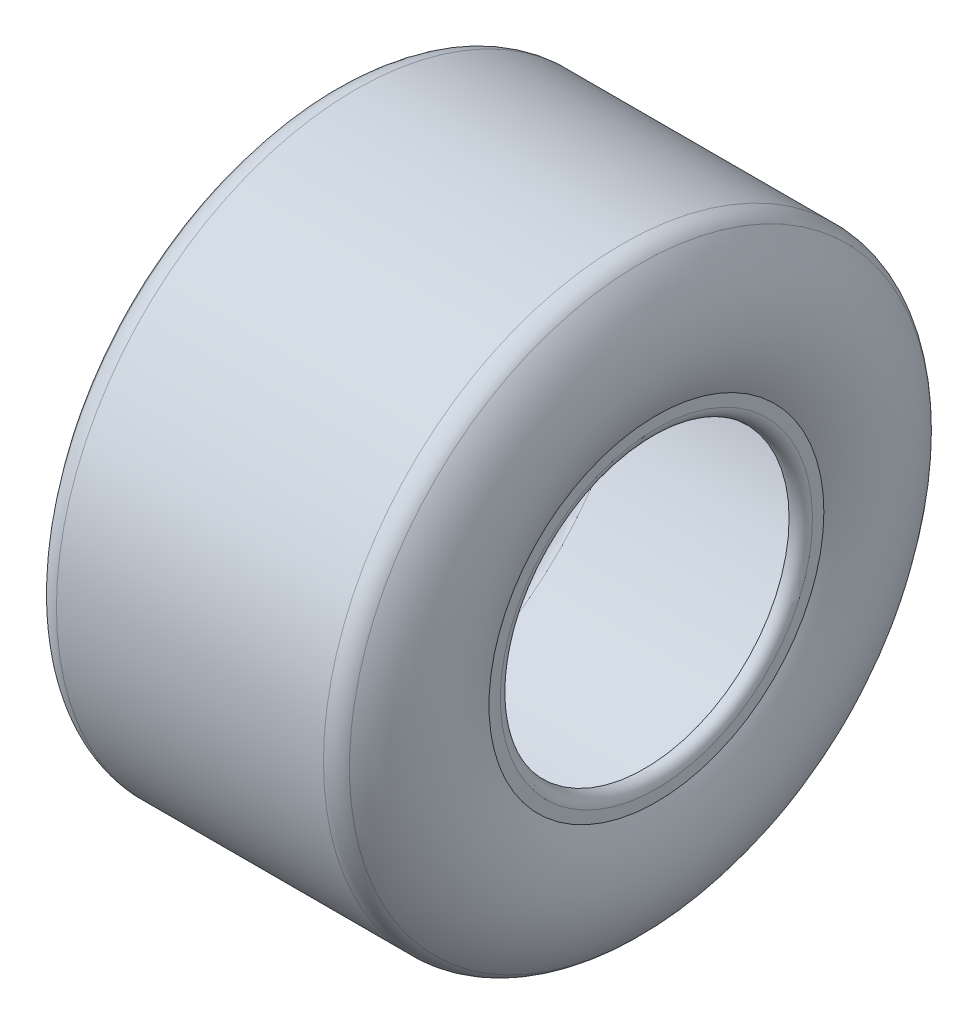
ISO-10303-21;
HEADER;
FILE_DESCRIPTION(('STEP AP214'),'2;1');
FILE_NAME('part.step','',(''),(''),'','','');
FILE_SCHEMA(('AUTOMOTIVE_DESIGN { 1 0 10303 214 1 1 1 1 }'));
ENDSEC;
DATA;
#1=APPLICATION_CONTEXT('core data for automotive mechanical design processes');
#2=APPLICATION_PROTOCOL_DEFINITION('international standard','automotive_design',2000,#1);
#3=PRODUCT_CONTEXT('',#1,'mechanical');
#4=PRODUCT('Part','Part','',(#3));
#5=PRODUCT_RELATED_PRODUCT_CATEGORY('part','',(#4));
#6=PRODUCT_DEFINITION_FORMATION('','',#4);
#7=PRODUCT_DEFINITION_CONTEXT('part definition',#1,'design');
#8=PRODUCT_DEFINITION('design','',#6,#7);
#9=PRODUCT_DEFINITION_SHAPE('','',#8);
#10=(LENGTH_UNIT() NAMED_UNIT(*) SI_UNIT(.MILLI.,.METRE.));
#11=(NAMED_UNIT(*) PLANE_ANGLE_UNIT() SI_UNIT($,.RADIAN.));
#12=(NAMED_UNIT(*) SI_UNIT($,.STERADIAN.) SOLID_ANGLE_UNIT());
#13=UNCERTAINTY_MEASURE_WITH_UNIT(LENGTH_MEASURE(1.E-05),#10,'distance_accuracy_value','');
#14=(GEOMETRIC_REPRESENTATION_CONTEXT(3) GLOBAL_UNCERTAINTY_ASSIGNED_CONTEXT((#13)) GLOBAL_UNIT_ASSIGNED_CONTEXT((#10,
#11,#12)) REPRESENTATION_CONTEXT('',''));
#15=CARTESIAN_POINT('',(0.,0.,0.));
#16=DIRECTION('',(0.,0.,1.));
#17=DIRECTION('',(1.,0.,0.));
#18=AXIS2_PLACEMENT_3D('',#15,#16,#17);
#19=CARTESIAN_POINT('',(55.8152266644166,0.,0.));
#20=DIRECTION('',(1.,0.,0.));
#21=DIRECTION('',(0.,0.,-1.));
#22=AXIS2_PLACEMENT_3D('',#19,#20,#21);
#23=TOROIDAL_SURFACE('',#22,115.,10.);
#24=CARTESIAN_POINT('',(55.8152266644166,0.,0.));
#25=DIRECTION('',(1.,0.,0.));
#26=DIRECTION('',(0.,0.,-1.));
#27=AXIS2_PLACEMENT_3D('',#24,#25,#26);
#28=CIRCLE('',#27,125.);
#29=CARTESIAN_POINT('',(55.8152266644166,0.,-125.));
#30=VERTEX_POINT('',#29);
#31=EDGE_CURVE('E10',#30,#30,#28,.T.);
#32=ORIENTED_EDGE('',*,*,#31,.T.);
#33=EDGE_LOOP('',(#32));
#34=FACE_BOUND('',#33,.T.);
#35=CARTESIAN_POINT('',(63.3059142321507,0.,0.));
#36=DIRECTION('',(1.,0.,0.));
#37=DIRECTION('',(0.,0.,-1.));
#38=AXIS2_PLACEMENT_3D('',#35,#36,#37);
#39=CIRCLE('',#38,121.62492262314);
#40=CARTESIAN_POINT('',(63.3059142321507,0.,-121.62492262314));
#41=VERTEX_POINT('',#40);
#42=EDGE_CURVE('E40',#41,#41,#39,.T.);
#43=ORIENTED_EDGE('',*,*,#42,.F.);
#44=EDGE_LOOP('',(#43));
#45=FACE_BOUND('',#44,.T.);
#46=ADVANCED_FACE('F34',(#34,#45),#23,.T.);
#47=CARTESIAN_POINT('',(28.5310288243146,0.,0.));
#48=DIRECTION('',(1.,0.,0.));
#49=DIRECTION('',(0.,0.,-1.));
#50=AXIS2_PLACEMENT_3D('',#47,#48,#49);
#51=TOROIDAL_SURFACE('',#50,90.8692779680572,46.4241567858574);
#52=ORIENTED_EDGE('',*,*,#42,.T.);
#53=EDGE_LOOP('',(#52));
#54=FACE_BOUND('',#53,.T.);
#55=CARTESIAN_POINT('',(70.,0.,0.));
#56=DIRECTION('',(1.,0.,0.));
#57=DIRECTION('',(0.,0.,-1.));
#58=AXIS2_PLACEMENT_3D('',#55,#56,#57);
#59=CIRCLE('',#58,70.);
#60=CARTESIAN_POINT('',(70.,0.,-70.));
#61=VERTEX_POINT('',#60);
#62=EDGE_CURVE('E44',#61,#61,#59,.T.);
#63=ORIENTED_EDGE('',*,*,#62,.F.);
#64=EDGE_LOOP('',(#63));
#65=FACE_BOUND('',#64,.T.);
#66=ADVANCED_FACE('F107',(#54,#65),#51,.T.);
#67=CARTESIAN_POINT('',(70.,70.,0.));
#68=DIRECTION('',(1.,0.,0.));
#69=DIRECTION('',(0.,0.,-1.));
#70=AXIS2_PLACEMENT_3D('',#67,#68,#69);
#71=PLANE('',#70);
#72=ORIENTED_EDGE('',*,*,#62,.T.);
#73=EDGE_LOOP('',(#72));
#74=FACE_BOUND('',#73,.T.);
#75=CARTESIAN_POINT('',(70.,0.,0.));
#76=DIRECTION('',(1.,0.,0.));
#77=DIRECTION('',(0.,0.,-1.));
#78=AXIS2_PLACEMENT_3D('',#75,#76,#77);
#79=CIRCLE('',#78,65.23);
#80=CARTESIAN_POINT('',(70.,0.,-65.23));
#81=VERTEX_POINT('',#80);
#82=EDGE_CURVE('E48',#81,#81,#79,.T.);
#83=ORIENTED_EDGE('',*,*,#82,.F.);
#84=EDGE_LOOP('',(#83));
#85=FACE_BOUND('',#84,.T.);
#86=ADVANCED_FACE('F111',(#74,#85),#71,.T.);
#87=CARTESIAN_POINT('',(65.115,0.,0.));
#88=DIRECTION('',(1.,0.,0.));
#89=DIRECTION('',(0.,0.,-1.));
#90=AXIS2_PLACEMENT_3D('',#87,#88,#89);
#91=TOROIDAL_SURFACE('',#90,65.345,4.88635344607817);
#92=ORIENTED_EDGE('',*,*,#82,.T.);
#93=EDGE_LOOP('',(#92));
#94=FACE_BOUND('',#93,.T.);
#95=CARTESIAN_POINT('',(65.,0.,0.));
#96=DIRECTION('',(1.,0.,0.));
#97=DIRECTION('',(0.,0.,-1.));
#98=AXIS2_PLACEMENT_3D('',#95,#96,#97);
#99=CIRCLE('',#98,60.46);
#100=CARTESIAN_POINT('',(65.,0.,-60.46));
#101=VERTEX_POINT('',#100);
#102=EDGE_CURVE('E53',#101,#101,#99,.T.);
#103=ORIENTED_EDGE('',*,*,#102,.F.);
#104=EDGE_LOOP('',(#103));
#105=FACE_BOUND('',#104,.T.);
#106=ADVANCED_FACE('F116',(#94,#105),#91,.T.);
#107=CARTESIAN_POINT('',(65.,71.2230338790126,0.));
#108=DIRECTION('',(-1.,0.,0.));
#109=DIRECTION('',(0.,0.,1.));
#110=AXIS2_PLACEMENT_3D('',#107,#108,#109);
#111=PLANE('',#110);
#112=ORIENTED_EDGE('',*,*,#102,.T.);
#113=EDGE_LOOP('',(#112));
#114=FACE_BOUND('',#113,.T.);
#115=CARTESIAN_POINT('',(65.,0.,0.));
#116=DIRECTION('',(1.,0.,0.));
#117=DIRECTION('',(0.,0.,-1.));
#118=AXIS2_PLACEMENT_3D('',#115,#116,#117);
#119=CIRCLE('',#118,71.2230338790126);
#120=CARTESIAN_POINT('',(65.,0.,-71.2230338790126));
#121=VERTEX_POINT('',#120);
#122=EDGE_CURVE('E56',#121,#121,#119,.T.);
#123=ORIENTED_EDGE('',*,*,#122,.F.);
#124=EDGE_LOOP('',(#123));
#125=FACE_BOUND('',#124,.T.);
#126=ADVANCED_FACE('F123',(#114,#125),#111,.T.);
#127=CARTESIAN_POINT('',(28.5310288243146,0.,0.));
#128=DIRECTION('',(1.,0.,0.));
#129=DIRECTION('',(0.,0.,-1.));
#130=AXIS2_PLACEMENT_3D('',#127,#128,#129);
#131=TOROIDAL_SURFACE('',#130,90.8692779680572,41.4241567858574);
#132=ORIENTED_EDGE('',*,*,#122,.T.);
#133=EDGE_LOOP('',(#132));
#134=FACE_BOUND('',#133,.T.);
#135=CARTESIAN_POINT('',(59.5605704482837,0.,0.));
#136=DIRECTION('',(1.,0.,0.));
#137=DIRECTION('',(0.,0.,-1.));
#138=AXIS2_PLACEMENT_3D('',#135,#136,#137);
#139=CIRCLE('',#138,118.31246131157);
#140=CARTESIAN_POINT('',(59.5605704482837,0.,-118.31246131157));
#141=VERTEX_POINT('',#140);
#142=EDGE_CURVE('E59',#141,#141,#139,.T.);
#143=ORIENTED_EDGE('',*,*,#142,.F.);
#144=EDGE_LOOP('',(#143));
#145=FACE_BOUND('',#144,.T.);
#146=ADVANCED_FACE('F127',(#134,#145),#131,.F.);
#147=CARTESIAN_POINT('',(55.8152266644166,0.,0.));
#148=DIRECTION('',(1.,0.,0.));
#149=DIRECTION('',(0.,0.,-1.));
#150=AXIS2_PLACEMENT_3D('',#147,#148,#149);
#151=TOROIDAL_SURFACE('',#150,115.,5.);
#152=ORIENTED_EDGE('',*,*,#142,.T.);
#153=EDGE_LOOP('',(#152));
#154=FACE_BOUND('',#153,.T.);
#155=CARTESIAN_POINT('',(55.8152266644166,0.,0.));
#156=DIRECTION('',(1.,0.,0.));
#157=DIRECTION('',(0.,0.,-1.));
#158=AXIS2_PLACEMENT_3D('',#155,#156,#157);
#159=CIRCLE('',#158,120.);
#160=CARTESIAN_POINT('',(55.8152266644166,0.,-120.));
#161=VERTEX_POINT('',#160);
#162=EDGE_CURVE('E62',#161,#161,#159,.T.);
#163=ORIENTED_EDGE('',*,*,#162,.F.);
#164=EDGE_LOOP('',(#163));
#165=FACE_BOUND('',#164,.T.);
#166=ADVANCED_FACE('F131',(#154,#165),#151,.F.);
#167=CARTESIAN_POINT('',(0.,0.,0.));
#168=DIRECTION('',(1.,0.,0.));
#169=DIRECTION('',(0.,0.,-1.));
#170=AXIS2_PLACEMENT_3D('',#167,#168,#169);
#171=CYLINDRICAL_SURFACE('',#170,120.);
#172=ORIENTED_EDGE('',*,*,#162,.T.);
#173=EDGE_LOOP('',(#172));
#174=FACE_BOUND('',#173,.T.);
#175=CARTESIAN_POINT('',(-55.8152266644166,0.,0.));
#176=DIRECTION('',(1.,0.,0.));
#177=DIRECTION('',(0.,0.,-1.));
#178=AXIS2_PLACEMENT_3D('',#175,#176,#177);
#179=CIRCLE('',#178,120.);
#180=CARTESIAN_POINT('',(-55.8152266644166,0.,-120.));
#181=VERTEX_POINT('',#180);
#182=EDGE_CURVE('E65',#181,#181,#179,.T.);
#183=ORIENTED_EDGE('',*,*,#182,.F.);
#184=EDGE_LOOP('',(#183));
#185=FACE_BOUND('',#184,.T.);
#186=ADVANCED_FACE('F135',(#174,#185),#171,.F.);
#187=CARTESIAN_POINT('',(-55.8152266644166,0.,0.));
#188=DIRECTION('',(1.,0.,0.));
#189=DIRECTION('',(0.,0.,-1.));
#190=AXIS2_PLACEMENT_3D('',#187,#188,#189);
#191=TOROIDAL_SURFACE('',#190,115.,5.);
#192=ORIENTED_EDGE('',*,*,#182,.T.);
#193=EDGE_LOOP('',(#192));
#194=FACE_BOUND('',#193,.T.);
#195=CARTESIAN_POINT('',(-59.5605704482837,0.,0.));
#196=DIRECTION('',(1.,0.,0.));
#197=DIRECTION('',(0.,0.,-1.));
#198=AXIS2_PLACEMENT_3D('',#195,#196,#197);
#199=CIRCLE('',#198,118.31246131157);
#200=CARTESIAN_POINT('',(-59.5605704482837,0.,-118.31246131157));
#201=VERTEX_POINT('',#200);
#202=EDGE_CURVE('E68',#201,#201,#199,.T.);
#203=ORIENTED_EDGE('',*,*,#202,.F.);
#204=EDGE_LOOP('',(#203));
#205=FACE_BOUND('',#204,.T.);
#206=ADVANCED_FACE('F139',(#194,#205),#191,.F.);
#207=CARTESIAN_POINT('',(-28.5310288243146,0.,0.));
#208=DIRECTION('',(1.,0.,0.));
#209=DIRECTION('',(0.,0.,-1.));
#210=AXIS2_PLACEMENT_3D('',#207,#208,#209);
#211=TOROIDAL_SURFACE('',#210,90.8692779680572,41.4241567858574);
#212=ORIENTED_EDGE('',*,*,#202,.T.);
#213=EDGE_LOOP('',(#212));
#214=FACE_BOUND('',#213,.T.);
#215=CARTESIAN_POINT('',(-65.,0.,0.));
#216=DIRECTION('',(1.,0.,0.));
#217=DIRECTION('',(0.,0.,-1.));
#218=AXIS2_PLACEMENT_3D('',#215,#216,#217);
#219=CIRCLE('',#218,71.2230338790126);
#220=CARTESIAN_POINT('',(-65.,0.,-71.2230338790126));
#221=VERTEX_POINT('',#220);
#222=EDGE_CURVE('E71',#221,#221,#219,.T.);
#223=ORIENTED_EDGE('',*,*,#222,.F.);
#224=EDGE_LOOP('',(#223));
#225=FACE_BOUND('',#224,.T.);
#226=ADVANCED_FACE('F143',(#214,#225),#211,.F.);
#227=CARTESIAN_POINT('',(-65.,71.2230338790126,0.));
#228=DIRECTION('',(1.,0.,0.));
#229=DIRECTION('',(0.,0.,-1.));
#230=AXIS2_PLACEMENT_3D('',#227,#228,#229);
#231=PLANE('',#230);
#232=ORIENTED_EDGE('',*,*,#222,.T.);
#233=EDGE_LOOP('',(#232));
#234=FACE_BOUND('',#233,.T.);
#235=CARTESIAN_POINT('',(-65.,0.,0.));
#236=DIRECTION('',(1.,0.,0.));
#237=DIRECTION('',(0.,0.,-1.));
#238=AXIS2_PLACEMENT_3D('',#235,#236,#237);
#239=CIRCLE('',#238,60.46);
#240=CARTESIAN_POINT('',(-65.,0.,-60.46));
#241=VERTEX_POINT('',#240);
#242=EDGE_CURVE('E74',#241,#241,#239,.T.);
#243=ORIENTED_EDGE('',*,*,#242,.F.);
#244=EDGE_LOOP('',(#243));
#245=FACE_BOUND('',#244,.T.);
#246=ADVANCED_FACE('F147',(#234,#245),#231,.T.);
#247=CARTESIAN_POINT('',(-65.115,0.,0.));
#248=DIRECTION('',(1.,0.,0.));
#249=DIRECTION('',(0.,0.,-1.));
#250=AXIS2_PLACEMENT_3D('',#247,#248,#249);
#251=TOROIDAL_SURFACE('',#250,65.345,4.88635344607817);
#252=ORIENTED_EDGE('',*,*,#242,.T.);
#253=EDGE_LOOP('',(#252));
#254=FACE_BOUND('',#253,.T.);
#255=CARTESIAN_POINT('',(-70.,0.,0.));
#256=DIRECTION('',(1.,0.,0.));
#257=DIRECTION('',(0.,0.,-1.));
#258=AXIS2_PLACEMENT_3D('',#255,#256,#257);
#259=CIRCLE('',#258,65.23);
#260=CARTESIAN_POINT('',(-70.,0.,-65.23));
#261=VERTEX_POINT('',#260);
#262=EDGE_CURVE('E77',#261,#261,#259,.T.);
#263=ORIENTED_EDGE('',*,*,#262,.F.);
#264=EDGE_LOOP('',(#263));
#265=FACE_BOUND('',#264,.T.);
#266=ADVANCED_FACE('F151',(#254,#265),#251,.T.);
#267=CARTESIAN_POINT('',(-70.,70.,0.));
#268=DIRECTION('',(-1.,0.,0.));
#269=DIRECTION('',(0.,0.,1.));
#270=AXIS2_PLACEMENT_3D('',#267,#268,#269);
#271=PLANE('',#270);
#272=ORIENTED_EDGE('',*,*,#262,.T.);
#273=EDGE_LOOP('',(#272));
#274=FACE_BOUND('',#273,.T.);
#275=CARTESIAN_POINT('',(-70.,0.,0.));
#276=DIRECTION('',(1.,0.,0.));
#277=DIRECTION('',(0.,0.,-1.));
#278=AXIS2_PLACEMENT_3D('',#275,#276,#277);
#279=CIRCLE('',#278,70.);
#280=CARTESIAN_POINT('',(-70.,0.,-70.));
#281=VERTEX_POINT('',#280);
#282=EDGE_CURVE('E80',#281,#281,#279,.T.);
#283=ORIENTED_EDGE('',*,*,#282,.F.);
#284=EDGE_LOOP('',(#283));
#285=FACE_BOUND('',#284,.T.);
#286=ADVANCED_FACE('F103',(#274,#285),#271,.T.);
#287=CARTESIAN_POINT('',(-28.5310288243146,0.,0.));
#288=DIRECTION('',(1.,0.,0.));
#289=DIRECTION('',(0.,0.,-1.));
#290=AXIS2_PLACEMENT_3D('',#287,#288,#289);
#291=TOROIDAL_SURFACE('',#290,90.8692779680572,46.4241567858574);
#292=ORIENTED_EDGE('',*,*,#282,.T.);
#293=EDGE_LOOP('',(#292));
#294=FACE_BOUND('',#293,.T.);
#295=CARTESIAN_POINT('',(-63.3059142321507,0.,0.));
#296=DIRECTION('',(1.,0.,0.));
#297=DIRECTION('',(0.,0.,-1.));
#298=AXIS2_PLACEMENT_3D('',#295,#296,#297);
#299=CIRCLE('',#298,121.62492262314);
#300=CARTESIAN_POINT('',(-63.3059142321507,0.,-121.62492262314));
#301=VERTEX_POINT('',#300);
#302=EDGE_CURVE('E83',#301,#301,#299,.T.);
#303=ORIENTED_EDGE('',*,*,#302,.F.);
#304=EDGE_LOOP('',(#303));
#305=FACE_BOUND('',#304,.T.);
#306=ADVANCED_FACE('F95',(#294,#305),#291,.T.);
#307=CARTESIAN_POINT('',(-55.8152266644166,0.,0.));
#308=DIRECTION('',(1.,0.,0.));
#309=DIRECTION('',(0.,0.,-1.));
#310=AXIS2_PLACEMENT_3D('',#307,#308,#309);
#311=TOROIDAL_SURFACE('',#310,115.,10.);
#312=ORIENTED_EDGE('',*,*,#302,.T.);
#313=EDGE_LOOP('',(#312));
#314=FACE_BOUND('',#313,.T.);
#315=CARTESIAN_POINT('',(-55.8152266644166,0.,0.));
#316=DIRECTION('',(1.,0.,0.));
#317=DIRECTION('',(0.,0.,-1.));
#318=AXIS2_PLACEMENT_3D('',#315,#316,#317);
#319=CIRCLE('',#318,125.);
#320=CARTESIAN_POINT('',(-55.8152266644166,0.,-125.));
#321=VERTEX_POINT('',#320);
#322=EDGE_CURVE('E86',#321,#321,#319,.T.);
#323=ORIENTED_EDGE('',*,*,#322,.F.);
#324=EDGE_LOOP('',(#323));
#325=FACE_BOUND('',#324,.T.);
#326=ADVANCED_FACE('F93',(#314,#325),#311,.T.);
#327=CARTESIAN_POINT('',(0.,0.,0.));
#328=DIRECTION('',(1.,0.,0.));
#329=DIRECTION('',(0.,0.,-1.));
#330=AXIS2_PLACEMENT_3D('',#327,#328,#329);
#331=CYLINDRICAL_SURFACE('',#330,125.);
#332=ORIENTED_EDGE('',*,*,#322,.T.);
#333=EDGE_LOOP('',(#332));
#334=FACE_BOUND('',#333,.T.);
#335=ORIENTED_EDGE('',*,*,#31,.F.);
#336=EDGE_LOOP('',(#335));
#337=FACE_BOUND('',#336,.T.);
#338=ADVANCED_FACE('F90',(#334,#337),#331,.T.);
#339=CLOSED_SHELL('',(#46,#66,#86,#106,#126,#146,#166,#186,#206,#226,#246,#266,#286,#306,#326,#338));
#340=MANIFOLD_SOLID_BREP('B2',#339);
#341=ADVANCED_BREP_SHAPE_REPRESENTATION('',(#18,#340),#14);
#342=SHAPE_DEFINITION_REPRESENTATION(#9,#341);
ENDSEC;
END-ISO-10303-21;
